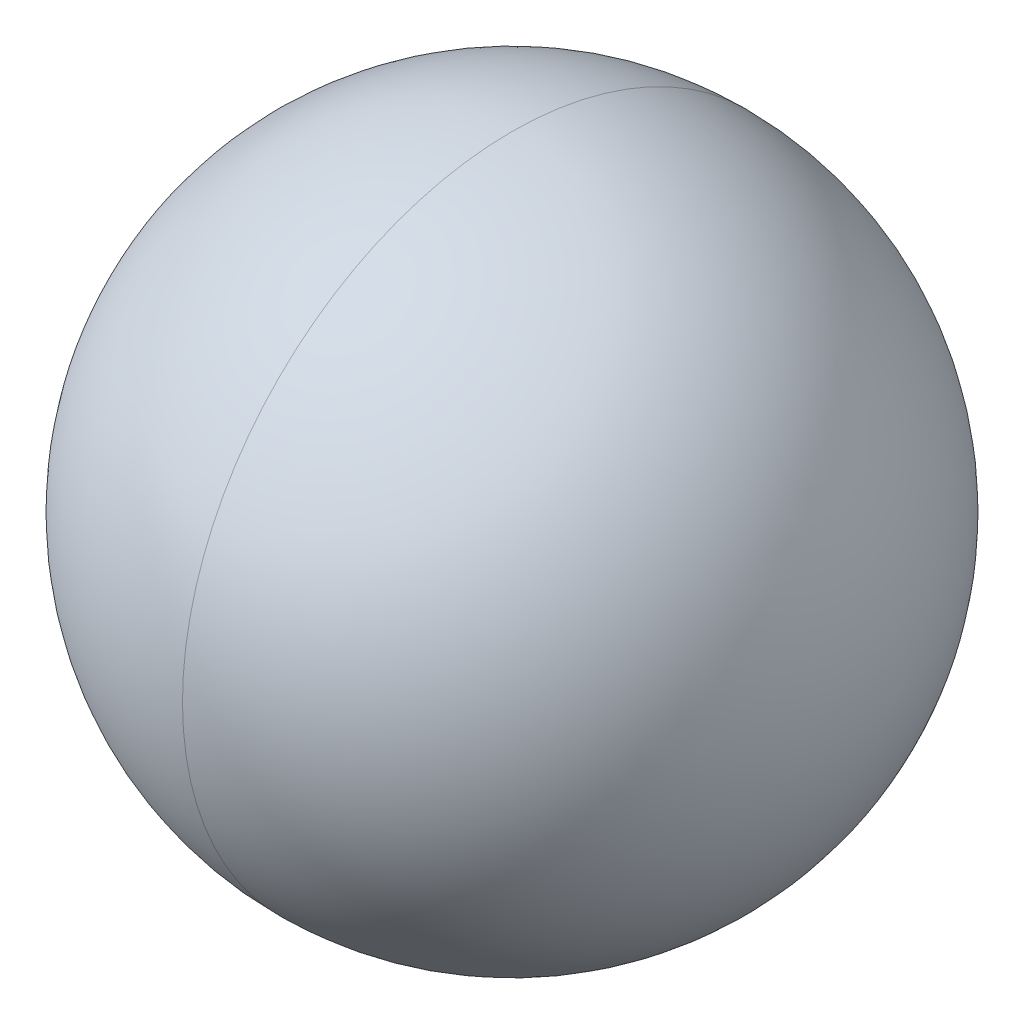
ISO-10303-21;
HEADER;
FILE_DESCRIPTION(('STEP AP214'),'2;1');
FILE_NAME('part.step','',(''),(''),'','','');
FILE_SCHEMA(('AUTOMOTIVE_DESIGN { 1 0 10303 214 1 1 1 1 }'));
ENDSEC;
DATA;
#1=APPLICATION_CONTEXT('core data for automotive mechanical design processes');
#2=APPLICATION_PROTOCOL_DEFINITION('international standard','automotive_design',2000,#1);
#3=PRODUCT_CONTEXT('',#1,'mechanical');
#4=PRODUCT('Part','Part','',(#3));
#5=PRODUCT_RELATED_PRODUCT_CATEGORY('part','',(#4));
#6=PRODUCT_DEFINITION_FORMATION('','',#4);
#7=PRODUCT_DEFINITION_CONTEXT('part definition',#1,'design');
#8=PRODUCT_DEFINITION('design','',#6,#7);
#9=PRODUCT_DEFINITION_SHAPE('','',#8);
#10=(LENGTH_UNIT() NAMED_UNIT(*) SI_UNIT(.MILLI.,.METRE.));
#11=(NAMED_UNIT(*) PLANE_ANGLE_UNIT() SI_UNIT($,.RADIAN.));
#12=(NAMED_UNIT(*) SI_UNIT($,.STERADIAN.) SOLID_ANGLE_UNIT());
#13=UNCERTAINTY_MEASURE_WITH_UNIT(LENGTH_MEASURE(1.E-05),#10,'distance_accuracy_value','');
#14=(GEOMETRIC_REPRESENTATION_CONTEXT(3) GLOBAL_UNCERTAINTY_ASSIGNED_CONTEXT((#13)) GLOBAL_UNIT_ASSIGNED_CONTEXT((#10,
#11,#12)) REPRESENTATION_CONTEXT('',''));
#15=CARTESIAN_POINT('',(0.,0.,0.));
#16=DIRECTION('',(0.,0.,1.));
#17=DIRECTION('',(1.,0.,0.));
#18=AXIS2_PLACEMENT_3D('',#15,#16,#17);
#19=CARTESIAN_POINT('',(-0.175,0.175,-0.01));
#20=DIRECTION('',(1.,0.,0.));
#21=DIRECTION('',(0.,1.,0.));
#22=AXIS2_PLACEMENT_3D('',#19,#20,#21);
#23=SPHERICAL_SURFACE('',#22,0.09);
#24=CARTESIAN_POINT('',(-0.175,0.175,-0.01));
#25=DIRECTION('',(-1.,0.,0.));
#26=DIRECTION('',(0.,0.,1.));
#27=AXIS2_PLACEMENT_3D('',#24,#25,#26);
#28=CIRCLE('',#27,0.09);
#29=CARTESIAN_POINT('',(-0.175,0.265,-0.01));
#30=VERTEX_POINT('',#29);
#31=CARTESIAN_POINT('',(-0.175,0.175,-0.1));
#32=VERTEX_POINT('',#31);
#33=EDGE_CURVE('E11',#30,#32,#28,.T.);
#34=ORIENTED_EDGE('',*,*,#33,.F.);
#35=CARTESIAN_POINT('',(-0.175,0.265,-0.01));
#36=CARTESIAN_POINT('',(-0.146725666117691,0.264999999999999,-0.00999999999999997));
#37=CARTESIAN_POINT('',(-0.11842495209734,0.253928649635885,-0.01));
#38=CARTESIAN_POINT('',(-0.0960713503641158,0.23157504790266,-0.00999999999999997));
#39=CARTESIAN_POINT('',(-0.0850000000000002,0.203274333882309,-0.01));
#40=CARTESIAN_POINT('',(-0.085,0.175,-0.01));
#41=B_SPLINE_CURVE_WITH_KNOTS('',5,(#35,#36,#37,#38,#39,#40),.UNSPECIFIED.,.F.,.F.,(6,6),(0.,
1.5707963267949),.UNSPECIFIED.);
#42=CARTESIAN_POINT('',(-0.085,0.175,-0.01));
#43=VERTEX_POINT('',#42);
#44=EDGE_CURVE('E24',#30,#43,#41,.T.);
#45=ORIENTED_EDGE('',*,*,#44,.T.);
#46=ORIENTED_EDGE('',*,*,#44,.F.);
#47=CARTESIAN_POINT('',(-0.175,0.175,0.08));
#48=VERTEX_POINT('',#47);
#49=EDGE_CURVE('E25',#48,#30,#28,.T.);
#50=ORIENTED_EDGE('',*,*,#49,.F.);
#51=CARTESIAN_POINT('',(-0.175,0.175,-0.01));
#52=DIRECTION('',(1.,0.,0.));
#53=DIRECTION('',(0.,1.,0.));
#54=AXIS2_PLACEMENT_3D('',#51,#52,#53);
#55=CIRCLE('',#54,0.09);
#56=EDGE_CURVE('E46',#48,#32,#55,.T.);
#57=ORIENTED_EDGE('',*,*,#56,.T.);
#58=EDGE_LOOP('',(#34,#45,#46,#50,#57));
#59=FACE_BOUND('',#58,.T.);
#60=ADVANCED_FACE('F17',(#59),#23,.T.);
#61=CARTESIAN_POINT('',(-0.175,0.175,-0.01));
#62=DIRECTION('',(1.,0.,0.));
#63=DIRECTION('',(0.,1.,0.));
#64=AXIS2_PLACEMENT_3D('',#61,#62,#63);
#65=SPHERICAL_SURFACE('',#64,0.09);
#66=ORIENTED_EDGE('',*,*,#56,.F.);
#67=ORIENTED_EDGE('',*,*,#49,.T.);
#68=CARTESIAN_POINT('',(-0.265,0.175,-0.01));
#69=CARTESIAN_POINT('',(-0.264999999999999,0.203274333882308,-0.00999999999999998));
#70=CARTESIAN_POINT('',(-0.253928649635884,0.231575047902661,-0.0100000000000001));
#71=CARTESIAN_POINT('',(-0.231575047902661,0.253928649635884,-0.00999999999999999));
#72=CARTESIAN_POINT('',(-0.203274333882308,0.265,-0.01));
#73=CARTESIAN_POINT('',(-0.175,0.265,-0.01));
#74=B_SPLINE_CURVE_WITH_KNOTS('',5,(#68,#69,#70,#71,#72,#73),.UNSPECIFIED.,.F.,.F.,(6,6),
(-1.5707963267949,0.),.UNSPECIFIED.);
#75=CARTESIAN_POINT('',(-0.265,0.175,-0.01));
#76=VERTEX_POINT('',#75);
#77=EDGE_CURVE('E44',#76,#30,#74,.T.);
#78=ORIENTED_EDGE('',*,*,#77,.F.);
#79=ORIENTED_EDGE('',*,*,#77,.T.);
#80=ORIENTED_EDGE('',*,*,#33,.T.);
#81=EDGE_LOOP('',(#66,#67,#78,#79,#80));
#82=FACE_BOUND('',#81,.T.);
#83=ADVANCED_FACE('F45',(#82),#65,.T.);
#84=CLOSED_SHELL('',(#60,#83));
#85=MANIFOLD_SOLID_BREP('B1',#84);
#86=ADVANCED_BREP_SHAPE_REPRESENTATION('',(#18,#85),#14);
#87=SHAPE_DEFINITION_REPRESENTATION(#9,#86);
ENDSEC;
END-ISO-10303-21;
